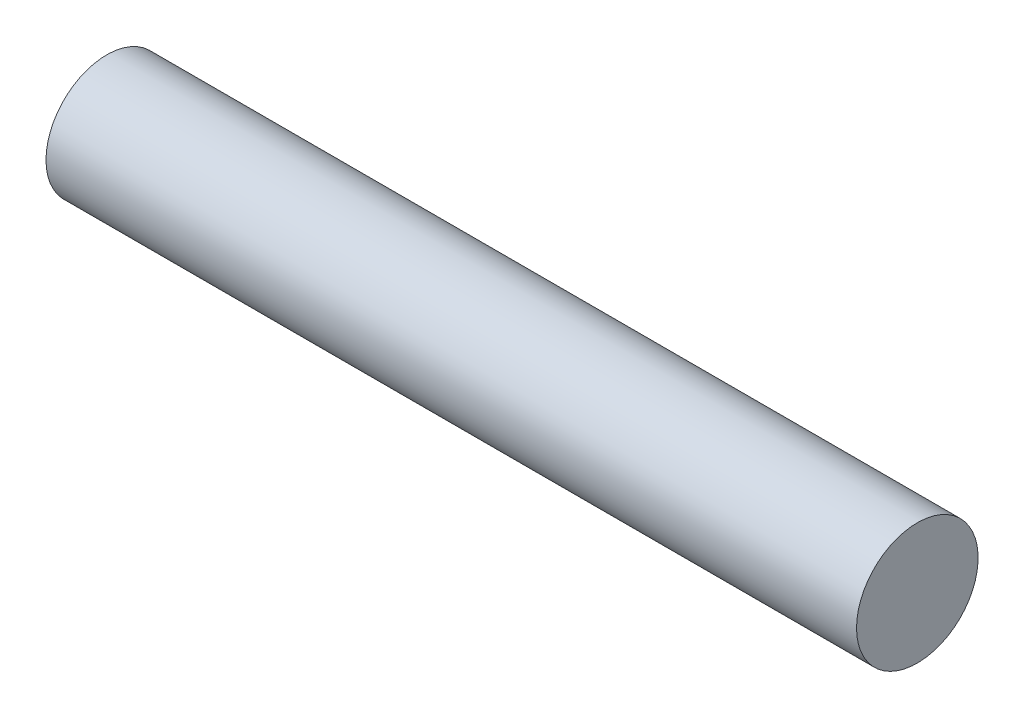
ISO-10303-21;
HEADER;
FILE_DESCRIPTION(('STEP AP214'),'2;1');
FILE_NAME('part.step','',(''),(''),'','','');
FILE_SCHEMA(('AUTOMOTIVE_DESIGN { 1 0 10303 214 1 1 1 1 }'));
ENDSEC;
DATA;
#1=APPLICATION_CONTEXT('core data for automotive mechanical design processes');
#2=APPLICATION_PROTOCOL_DEFINITION('international standard','automotive_design',2000,#1);
#3=PRODUCT_CONTEXT('',#1,'mechanical');
#4=PRODUCT('Part','Part','',(#3));
#5=PRODUCT_RELATED_PRODUCT_CATEGORY('part','',(#4));
#6=PRODUCT_DEFINITION_FORMATION('','',#4);
#7=PRODUCT_DEFINITION_CONTEXT('part definition',#1,'design');
#8=PRODUCT_DEFINITION('design','',#6,#7);
#9=PRODUCT_DEFINITION_SHAPE('','',#8);
#10=(LENGTH_UNIT() NAMED_UNIT(*) SI_UNIT(.MILLI.,.METRE.));
#11=(NAMED_UNIT(*) PLANE_ANGLE_UNIT() SI_UNIT($,.RADIAN.));
#12=(NAMED_UNIT(*) SI_UNIT($,.STERADIAN.) SOLID_ANGLE_UNIT());
#13=UNCERTAINTY_MEASURE_WITH_UNIT(LENGTH_MEASURE(1.E-05),#10,'distance_accuracy_value','');
#14=(GEOMETRIC_REPRESENTATION_CONTEXT(3) GLOBAL_UNCERTAINTY_ASSIGNED_CONTEXT((#13)) GLOBAL_UNIT_ASSIGNED_CONTEXT((#10,
#11,#12)) REPRESENTATION_CONTEXT('',''));
#15=CARTESIAN_POINT('',(0.,0.,0.));
#16=DIRECTION('',(0.,0.,1.));
#17=DIRECTION('',(1.,0.,0.));
#18=AXIS2_PLACEMENT_3D('',#15,#16,#17);
#19=CARTESIAN_POINT('',(0.,0.,0.));
#20=DIRECTION('',(-1.,0.,0.));
#21=DIRECTION('',(0.,0.,1.));
#22=AXIS2_PLACEMENT_3D('',#19,#20,#21);
#23=CYLINDRICAL_SURFACE('',#22,4.5);
#24=CARTESIAN_POINT('',(60.,0.,0.));
#25=DIRECTION('',(-1.,0.,0.));
#26=DIRECTION('',(0.,0.,1.));
#27=AXIS2_PLACEMENT_3D('',#24,#25,#26);
#28=CIRCLE('',#27,4.5);
#29=CARTESIAN_POINT('',(60.,0.,4.5));
#30=VERTEX_POINT('',#29);
#31=EDGE_CURVE('E41',#30,#30,#28,.T.);
#32=ORIENTED_EDGE('',*,*,#31,.T.);
#33=EDGE_LOOP('',(#32));
#34=FACE_BOUND('',#33,.T.);
#35=CARTESIAN_POINT('',(0.,0.,0.));
#36=DIRECTION('',(-1.,0.,0.));
#37=DIRECTION('',(0.,0.,1.));
#38=AXIS2_PLACEMENT_3D('',#35,#36,#37);
#39=CIRCLE('',#38,4.5);
#40=CARTESIAN_POINT('',(0.,0.,4.5));
#41=VERTEX_POINT('',#40);
#42=EDGE_CURVE('E10',#41,#41,#39,.T.);
#43=ORIENTED_EDGE('',*,*,#42,.F.);
#44=EDGE_LOOP('',(#43));
#45=FACE_BOUND('',#44,.T.);
#46=ADVANCED_FACE('F35',(#34,#45),#23,.T.);
#47=CARTESIAN_POINT('',(0.,-4.5,0.));
#48=DIRECTION('',(1.,0.,0.));
#49=DIRECTION('',(0.,0.,-1.));
#50=AXIS2_PLACEMENT_3D('',#47,#48,#49);
#51=PLANE('',#50);
#52=ORIENTED_EDGE('',*,*,#42,.T.);
#53=EDGE_LOOP('',(#52));
#54=FACE_BOUND('',#53,.T.);
#55=ADVANCED_FACE('F51',(#54),#51,.F.);
#56=CARTESIAN_POINT('',(60.,0.,0.));
#57=DIRECTION('',(-1.,0.,0.));
#58=DIRECTION('',(0.,0.,1.));
#59=AXIS2_PLACEMENT_3D('',#56,#57,#58);
#60=PLANE('',#59);
#61=ORIENTED_EDGE('',*,*,#31,.F.);
#62=EDGE_LOOP('',(#61));
#63=FACE_BOUND('',#62,.T.);
#64=ADVANCED_FACE('F49',(#63),#60,.F.);
#65=CLOSED_SHELL('',(#46,#55,#64));
#66=MANIFOLD_SOLID_BREP('B2',#65);
#67=ADVANCED_BREP_SHAPE_REPRESENTATION('',(#18,#66),#14);
#68=SHAPE_DEFINITION_REPRESENTATION(#9,#67);
ENDSEC;
END-ISO-10303-21;
